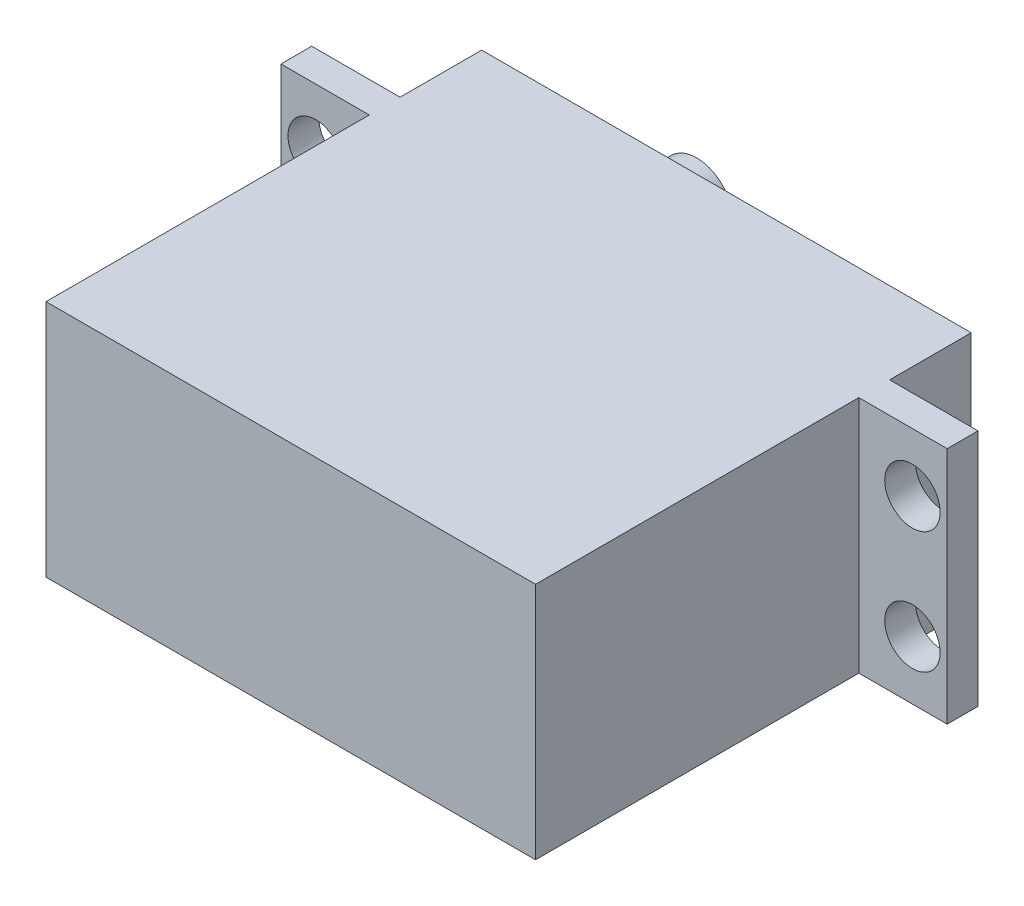
ISO-10303-21;
HEADER;
FILE_DESCRIPTION(('STEP AP214'),'2;1');
FILE_NAME('part.step','',(''),(''),'','','');
FILE_SCHEMA(('AUTOMOTIVE_DESIGN { 1 0 10303 214 1 1 1 1 }'));
ENDSEC;
DATA;
#1=APPLICATION_CONTEXT('core data for automotive mechanical design processes');
#2=APPLICATION_PROTOCOL_DEFINITION('international standard','automotive_design',2000,#1);
#3=PRODUCT_CONTEXT('',#1,'mechanical');
#4=PRODUCT('Part','Part','',(#3));
#5=PRODUCT_RELATED_PRODUCT_CATEGORY('part','',(#4));
#6=PRODUCT_DEFINITION_FORMATION('','',#4);
#7=PRODUCT_DEFINITION_CONTEXT('part definition',#1,'design');
#8=PRODUCT_DEFINITION('design','',#6,#7);
#9=PRODUCT_DEFINITION_SHAPE('','',#8);
#10=(LENGTH_UNIT() NAMED_UNIT(*) SI_UNIT(.MILLI.,.METRE.));
#11=(NAMED_UNIT(*) PLANE_ANGLE_UNIT() SI_UNIT($,.RADIAN.));
#12=(NAMED_UNIT(*) SI_UNIT($,.STERADIAN.) SOLID_ANGLE_UNIT());
#13=UNCERTAINTY_MEASURE_WITH_UNIT(LENGTH_MEASURE(1.E-05),#10,'distance_accuracy_value','');
#14=(GEOMETRIC_REPRESENTATION_CONTEXT(3) GLOBAL_UNCERTAINTY_ASSIGNED_CONTEXT((#13)) GLOBAL_UNIT_ASSIGNED_CONTEXT((#10,
#11,#12)) REPRESENTATION_CONTEXT('',''));
#15=CARTESIAN_POINT('',(0.,0.,0.));
#16=DIRECTION('',(0.,0.,1.));
#17=DIRECTION('',(1.,0.,0.));
#18=AXIS2_PLACEMENT_3D('',#15,#16,#17);
#19=CARTESIAN_POINT('',(0.,19.685,-35.941));
#20=DIRECTION('',(0.,0.,1.));
#21=DIRECTION('',(1.,0.,0.));
#22=AXIS2_PLACEMENT_3D('',#19,#20,#21);
#23=PLANE('',#22);
#24=DIRECTION('',(-1.,0.,0.));
#25=VECTOR('',#24,1.);
#26=CARTESIAN_POINT('',(0.,0.,-35.941));
#27=LINE('',#26,#25);
#28=CARTESIAN_POINT('',(40.386,0.,-35.941));
#29=VERTEX_POINT('',#28);
#30=CARTESIAN_POINT('',(0.,0.,-35.941));
#31=VERTEX_POINT('',#30);
#32=EDGE_CURVE('E215',#29,#31,#27,.T.);
#33=ORIENTED_EDGE('',*,*,#32,.T.);
#34=DIRECTION('',(0.,-1.,0.));
#35=VECTOR('',#34,1.);
#36=CARTESIAN_POINT('',(0.,19.685,-35.941));
#37=LINE('',#36,#35);
#38=CARTESIAN_POINT('',(0.,19.685,-35.941));
#39=VERTEX_POINT('',#38);
#40=EDGE_CURVE('E233',#39,#31,#37,.T.);
#41=ORIENTED_EDGE('',*,*,#40,.F.);
#42=DIRECTION('',(-1.,0.,0.));
#43=VECTOR('',#42,1.);
#44=CARTESIAN_POINT('',(0.,19.685,-35.941));
#45=LINE('',#44,#43);
#46=CARTESIAN_POINT('',(40.386,19.685,-35.941));
#47=VERTEX_POINT('',#46);
#48=EDGE_CURVE('E297',#47,#39,#45,.T.);
#49=ORIENTED_EDGE('',*,*,#48,.F.);
#50=DIRECTION('',(0.,-1.,0.));
#51=VECTOR('',#50,1.);
#52=CARTESIAN_POINT('',(40.386,19.685,-35.941));
#53=LINE('',#52,#51);
#54=EDGE_CURVE('E237',#47,#29,#53,.T.);
#55=ORIENTED_EDGE('',*,*,#54,.T.);
#56=EDGE_LOOP('',(#33,#41,#49,#55));
#57=FACE_BOUND('',#56,.T.);
#58=CARTESIAN_POINT('',(9.7155,9.8425,-35.941));
#59=DIRECTION('',(0.,0.,1.));
#60=DIRECTION('',(1.,0.,0.));
#61=AXIS2_PLACEMENT_3D('',#58,#59,#60);
#62=CIRCLE('',#61,2.9845);
#63=CARTESIAN_POINT('',(12.7,9.8425,-35.941));
#64=VERTEX_POINT('',#63);
#65=EDGE_CURVE('E11',#64,#64,#62,.F.);
#66=ORIENTED_EDGE('',*,*,#65,.F.);
#67=EDGE_LOOP('',(#66));
#68=FACE_BOUND('',#67,.T.);
#69=ADVANCED_FACE('F40',(#57,#68),#23,.F.);
#70=CARTESIAN_POINT('',(0.,19.685,0.));
#71=DIRECTION('',(1.,0.,0.));
#72=DIRECTION('',(0.,0.,-1.));
#73=AXIS2_PLACEMENT_3D('',#70,#71,#72);
#74=PLANE('',#73);
#75=DIRECTION('',(0.,0.,1.));
#76=VECTOR('',#75,1.);
#77=CARTESIAN_POINT('',(0.,0.,0.));
#78=LINE('',#77,#76);
#79=CARTESIAN_POINT('',(0.,0.,-26.67));
#80=VERTEX_POINT('',#79);
#81=CARTESIAN_POINT('',(0.,0.,0.));
#82=VERTEX_POINT('',#81);
#83=EDGE_CURVE('E192',#80,#82,#78,.T.);
#84=ORIENTED_EDGE('',*,*,#83,.T.);
#85=DIRECTION('',(0.,-1.,0.));
#86=VECTOR('',#85,1.);
#87=CARTESIAN_POINT('',(0.,19.685,0.));
#88=LINE('',#87,#86);
#89=CARTESIAN_POINT('',(0.,19.685,0.));
#90=VERTEX_POINT('',#89);
#91=EDGE_CURVE('E50',#90,#82,#88,.T.);
#92=ORIENTED_EDGE('',*,*,#91,.F.);
#93=DIRECTION('',(0.,0.,1.));
#94=VECTOR('',#93,1.);
#95=CARTESIAN_POINT('',(0.,19.685,0.));
#96=LINE('',#95,#94);
#97=CARTESIAN_POINT('',(0.,19.685,-26.67));
#98=VERTEX_POINT('',#97);
#99=EDGE_CURVE('E227',#98,#90,#96,.T.);
#100=ORIENTED_EDGE('',*,*,#99,.F.);
#101=DIRECTION('',(0.,-1.,0.));
#102=VECTOR('',#101,1.);
#103=CARTESIAN_POINT('',(0.,19.685,-26.67));
#104=LINE('',#103,#102);
#105=EDGE_CURVE('E188',#98,#80,#104,.T.);
#106=ORIENTED_EDGE('',*,*,#105,.T.);
#107=EDGE_LOOP('',(#84,#92,#100,#106));
#108=FACE_BOUND('',#107,.T.);
#109=ADVANCED_FACE('F42',(#108),#74,.F.);
#110=CARTESIAN_POINT('',(0.,19.685,0.));
#111=DIRECTION('',(0.,0.,-1.));
#112=DIRECTION('',(-1.,0.,0.));
#113=AXIS2_PLACEMENT_3D('',#110,#111,#112);
#114=PLANE('',#113);
#115=DIRECTION('',(1.,0.,0.));
#116=VECTOR('',#115,1.);
#117=CARTESIAN_POINT('',(0.,0.,0.));
#118=LINE('',#117,#116);
#119=CARTESIAN_POINT('',(40.386,0.,0.));
#120=VERTEX_POINT('',#119);
#121=EDGE_CURVE('E196',#82,#120,#118,.T.);
#122=ORIENTED_EDGE('',*,*,#121,.T.);
#123=DIRECTION('',(0.,-1.,0.));
#124=VECTOR('',#123,1.);
#125=CARTESIAN_POINT('',(40.386,19.685,0.));
#126=LINE('',#125,#124);
#127=CARTESIAN_POINT('',(40.386,19.685,0.));
#128=VERTEX_POINT('',#127);
#129=EDGE_CURVE('E257',#128,#120,#126,.T.);
#130=ORIENTED_EDGE('',*,*,#129,.F.);
#131=DIRECTION('',(1.,0.,0.));
#132=VECTOR('',#131,1.);
#133=CARTESIAN_POINT('',(0.,19.685,0.));
#134=LINE('',#133,#132);
#135=EDGE_CURVE('E133',#90,#128,#134,.T.);
#136=ORIENTED_EDGE('',*,*,#135,.F.);
#137=ORIENTED_EDGE('',*,*,#91,.T.);
#138=EDGE_LOOP('',(#122,#130,#136,#137));
#139=FACE_BOUND('',#138,.T.);
#140=ADVANCED_FACE('F262',(#139),#114,.F.);
#141=CARTESIAN_POINT('',(40.386,19.685,0.));
#142=DIRECTION('',(-1.,0.,0.));
#143=DIRECTION('',(0.,0.,1.));
#144=AXIS2_PLACEMENT_3D('',#141,#142,#143);
#145=PLANE('',#144);
#146=DIRECTION('',(0.,0.,-1.));
#147=VECTOR('',#146,1.);
#148=CARTESIAN_POINT('',(40.386,0.,0.));
#149=LINE('',#148,#147);
#150=CARTESIAN_POINT('',(40.386,0.,-26.67));
#151=VERTEX_POINT('',#150);
#152=EDGE_CURVE('E200',#120,#151,#149,.T.);
#153=ORIENTED_EDGE('',*,*,#152,.T.);
#154=DIRECTION('',(0.,-1.,0.));
#155=VECTOR('',#154,1.);
#156=CARTESIAN_POINT('',(40.386,19.685,-26.67));
#157=LINE('',#156,#155);
#158=CARTESIAN_POINT('',(40.386,19.685,-26.67));
#159=VERTEX_POINT('',#158);
#160=EDGE_CURVE('E253',#159,#151,#157,.T.);
#161=ORIENTED_EDGE('',*,*,#160,.F.);
#162=DIRECTION('',(0.,0.,-1.));
#163=VECTOR('',#162,1.);
#164=CARTESIAN_POINT('',(40.386,19.685,0.));
#165=LINE('',#164,#163);
#166=EDGE_CURVE('E283',#128,#159,#165,.T.);
#167=ORIENTED_EDGE('',*,*,#166,.F.);
#168=ORIENTED_EDGE('',*,*,#129,.T.);
#169=EDGE_LOOP('',(#153,#161,#167,#168));
#170=FACE_BOUND('',#169,.T.);
#171=ADVANCED_FACE('F273',(#170),#145,.F.);
#172=CARTESIAN_POINT('',(40.386,19.685,-26.67));
#173=DIRECTION('',(0.,0.,-1.));
#174=DIRECTION('',(-1.,0.,0.));
#175=AXIS2_PLACEMENT_3D('',#172,#173,#174);
#176=PLANE('',#175);
#177=CARTESIAN_POINT('',(44.8056,4.826,-26.67));
#178=DIRECTION('',(0.,0.,-1.));
#179=DIRECTION('',(-1.,0.,0.));
#180=AXIS2_PLACEMENT_3D('',#177,#178,#179);
#181=CIRCLE('',#180,2.28599999999999);
#182=CARTESIAN_POINT('',(42.5196,4.826,-26.67));
#183=VERTEX_POINT('',#182);
#184=EDGE_CURVE('E320',#183,#183,#181,.F.);
#185=ORIENTED_EDGE('',*,*,#184,.F.);
#186=EDGE_LOOP('',(#185));
#187=FACE_BOUND('',#186,.T.);
#188=CARTESIAN_POINT('',(44.8056,14.859,-26.67));
#189=DIRECTION('',(0.,0.,-1.));
#190=DIRECTION('',(-1.,0.,0.));
#191=AXIS2_PLACEMENT_3D('',#188,#189,#190);
#192=CIRCLE('',#191,2.28599999999999);
#193=CARTESIAN_POINT('',(42.5196,14.859,-26.67));
#194=VERTEX_POINT('',#193);
#195=EDGE_CURVE('E305',#194,#194,#192,.F.);
#196=ORIENTED_EDGE('',*,*,#195,.F.);
#197=EDGE_LOOP('',(#196));
#198=FACE_BOUND('',#197,.T.);
#199=DIRECTION('',(1.,0.,0.));
#200=VECTOR('',#199,1.);
#201=CARTESIAN_POINT('',(40.386,0.,-26.67));
#202=LINE('',#201,#200);
#203=CARTESIAN_POINT('',(47.6758,0.,-26.67));
#204=VERTEX_POINT('',#203);
#205=EDGE_CURVE('E203',#151,#204,#202,.T.);
#206=ORIENTED_EDGE('',*,*,#205,.T.);
#207=DIRECTION('',(0.,-1.,0.));
#208=VECTOR('',#207,1.);
#209=CARTESIAN_POINT('',(47.6758,19.685,-26.67));
#210=LINE('',#209,#208);
#211=CARTESIAN_POINT('',(47.6758,19.685,-26.67));
#212=VERTEX_POINT('',#211);
#213=EDGE_CURVE('E249',#212,#204,#210,.T.);
#214=ORIENTED_EDGE('',*,*,#213,.F.);
#215=DIRECTION('',(1.,0.,0.));
#216=VECTOR('',#215,1.);
#217=CARTESIAN_POINT('',(40.386,19.685,-26.67));
#218=LINE('',#217,#216);
#219=EDGE_CURVE('E279',#159,#212,#218,.T.);
#220=ORIENTED_EDGE('',*,*,#219,.F.);
#221=ORIENTED_EDGE('',*,*,#160,.T.);
#222=EDGE_LOOP('',(#206,#214,#220,#221));
#223=FACE_BOUND('',#222,.T.);
#224=ADVANCED_FACE('F277',(#187,#198,#223),#176,.F.);
#225=CARTESIAN_POINT('',(47.6758,19.685,-26.67));
#226=DIRECTION('',(-1.,0.,0.));
#227=DIRECTION('',(0.,0.,1.));
#228=AXIS2_PLACEMENT_3D('',#225,#226,#227);
#229=PLANE('',#228);
#230=DIRECTION('',(0.,0.,-1.));
#231=VECTOR('',#230,1.);
#232=CARTESIAN_POINT('',(47.6758,0.,-26.67));
#233=LINE('',#232,#231);
#234=CARTESIAN_POINT('',(47.6758,0.,-29.21));
#235=VERTEX_POINT('',#234);
#236=EDGE_CURVE('E206',#204,#235,#233,.T.);
#237=ORIENTED_EDGE('',*,*,#236,.T.);
#238=DIRECTION('',(0.,-1.,0.));
#239=VECTOR('',#238,1.);
#240=CARTESIAN_POINT('',(47.6758,19.685,-29.21));
#241=LINE('',#240,#239);
#242=CARTESIAN_POINT('',(47.6758,19.685,-29.21));
#243=VERTEX_POINT('',#242);
#244=EDGE_CURVE('E245',#243,#235,#241,.T.);
#245=ORIENTED_EDGE('',*,*,#244,.F.);
#246=DIRECTION('',(0.,0.,-1.));
#247=VECTOR('',#246,1.);
#248=CARTESIAN_POINT('',(47.6758,19.685,-26.67));
#249=LINE('',#248,#247);
#250=EDGE_CURVE('E282',#212,#243,#249,.T.);
#251=ORIENTED_EDGE('',*,*,#250,.F.);
#252=ORIENTED_EDGE('',*,*,#213,.T.);
#253=EDGE_LOOP('',(#237,#245,#251,#252));
#254=FACE_BOUND('',#253,.T.);
#255=ADVANCED_FACE('F379',(#254),#229,.F.);
#256=CARTESIAN_POINT('',(40.386,19.685,-29.21));
#257=DIRECTION('',(0.,0.,1.));
#258=DIRECTION('',(1.,0.,0.));
#259=AXIS2_PLACEMENT_3D('',#256,#257,#258);
#260=PLANE('',#259);
#261=CARTESIAN_POINT('',(44.8056,4.826,-29.21));
#262=DIRECTION('',(0.,0.,-1.));
#263=DIRECTION('',(-1.,0.,0.));
#264=AXIS2_PLACEMENT_3D('',#261,#262,#263);
#265=CIRCLE('',#264,2.28599999999999);
#266=CARTESIAN_POINT('',(42.5196,4.826,-29.21));
#267=VERTEX_POINT('',#266);
#268=EDGE_CURVE('E314',#267,#267,#265,.T.);
#269=ORIENTED_EDGE('',*,*,#268,.F.);
#270=EDGE_LOOP('',(#269));
#271=FACE_BOUND('',#270,.T.);
#272=CARTESIAN_POINT('',(44.8056,14.859,-29.21));
#273=DIRECTION('',(0.,0.,-1.));
#274=DIRECTION('',(-1.,0.,0.));
#275=AXIS2_PLACEMENT_3D('',#272,#273,#274);
#276=CIRCLE('',#275,2.28599999999999);
#277=CARTESIAN_POINT('',(42.5196,14.859,-29.21));
#278=VERTEX_POINT('',#277);
#279=EDGE_CURVE('E327',#278,#278,#276,.T.);
#280=ORIENTED_EDGE('',*,*,#279,.F.);
#281=EDGE_LOOP('',(#280));
#282=FACE_BOUND('',#281,.T.);
#283=DIRECTION('',(-1.,0.,0.));
#284=VECTOR('',#283,1.);
#285=CARTESIAN_POINT('',(40.386,0.,-29.21));
#286=LINE('',#285,#284);
#287=CARTESIAN_POINT('',(40.386,0.,-29.21));
#288=VERTEX_POINT('',#287);
#289=EDGE_CURVE('E209',#235,#288,#286,.T.);
#290=ORIENTED_EDGE('',*,*,#289,.T.);
#291=DIRECTION('',(0.,-1.,0.));
#292=VECTOR('',#291,1.);
#293=CARTESIAN_POINT('',(40.386,19.685,-29.21));
#294=LINE('',#293,#292);
#295=CARTESIAN_POINT('',(40.386,19.685,-29.21));
#296=VERTEX_POINT('',#295);
#297=EDGE_CURVE('E241',#296,#288,#294,.T.);
#298=ORIENTED_EDGE('',*,*,#297,.F.);
#299=DIRECTION('',(-1.,0.,0.));
#300=VECTOR('',#299,1.);
#301=CARTESIAN_POINT('',(40.386,19.685,-29.21));
#302=LINE('',#301,#300);
#303=EDGE_CURVE('E287',#243,#296,#302,.T.);
#304=ORIENTED_EDGE('',*,*,#303,.F.);
#305=ORIENTED_EDGE('',*,*,#244,.T.);
#306=EDGE_LOOP('',(#290,#298,#304,#305));
#307=FACE_BOUND('',#306,.T.);
#308=ADVANCED_FACE('F375',(#271,#282,#307),#260,.F.);
#309=CARTESIAN_POINT('',(40.386,19.685,-29.21));
#310=DIRECTION('',(-1.,0.,0.));
#311=DIRECTION('',(0.,0.,1.));
#312=AXIS2_PLACEMENT_3D('',#309,#310,#311);
#313=PLANE('',#312);
#314=DIRECTION('',(0.,0.,-1.));
#315=VECTOR('',#314,1.);
#316=CARTESIAN_POINT('',(40.386,0.,-29.21));
#317=LINE('',#316,#315);
#318=EDGE_CURVE('E212',#288,#29,#317,.T.);
#319=ORIENTED_EDGE('',*,*,#318,.T.);
#320=ORIENTED_EDGE('',*,*,#54,.F.);
#321=DIRECTION('',(0.,0.,-1.));
#322=VECTOR('',#321,1.);
#323=CARTESIAN_POINT('',(40.386,19.685,-29.21));
#324=LINE('',#323,#322);
#325=EDGE_CURVE('E294',#296,#47,#324,.T.);
#326=ORIENTED_EDGE('',*,*,#325,.F.);
#327=ORIENTED_EDGE('',*,*,#297,.T.);
#328=EDGE_LOOP('',(#319,#320,#326,#327));
#329=FACE_BOUND('',#328,.T.);
#330=ADVANCED_FACE('F372',(#329),#313,.F.);
#331=CARTESIAN_POINT('',(0.,19.685,-29.21));
#332=DIRECTION('',(1.,0.,0.));
#333=DIRECTION('',(0.,0.,-1.));
#334=AXIS2_PLACEMENT_3D('',#331,#332,#333);
#335=PLANE('',#334);
#336=DIRECTION('',(0.,0.,1.));
#337=VECTOR('',#336,1.);
#338=CARTESIAN_POINT('',(0.,0.,-29.21));
#339=LINE('',#338,#337);
#340=CARTESIAN_POINT('',(0.,0.,-29.21));
#341=VERTEX_POINT('',#340);
#342=EDGE_CURVE('E218',#31,#341,#339,.T.);
#343=ORIENTED_EDGE('',*,*,#342,.T.);
#344=DIRECTION('',(0.,-1.,0.));
#345=VECTOR('',#344,1.);
#346=CARTESIAN_POINT('',(0.,19.685,-29.21));
#347=LINE('',#346,#345);
#348=CARTESIAN_POINT('',(0.,19.685,-29.21));
#349=VERTEX_POINT('',#348);
#350=EDGE_CURVE('E180',#349,#341,#347,.T.);
#351=ORIENTED_EDGE('',*,*,#350,.F.);
#352=DIRECTION('',(0.,0.,1.));
#353=VECTOR('',#352,1.);
#354=CARTESIAN_POINT('',(0.,19.685,-29.21));
#355=LINE('',#354,#353);
#356=EDGE_CURVE('E169',#39,#349,#355,.T.);
#357=ORIENTED_EDGE('',*,*,#356,.F.);
#358=ORIENTED_EDGE('',*,*,#40,.T.);
#359=EDGE_LOOP('',(#343,#351,#357,#358));
#360=FACE_BOUND('',#359,.T.);
#361=ADVANCED_FACE('F347',(#360),#335,.F.);
#362=CARTESIAN_POINT('',(0.,19.685,-29.21));
#363=DIRECTION('',(0.,0.,1.));
#364=DIRECTION('',(1.,0.,0.));
#365=AXIS2_PLACEMENT_3D('',#362,#363,#364);
#366=PLANE('',#365);
#367=CARTESIAN_POINT('',(-4.4196,4.826,-29.21));
#368=DIRECTION('',(0.,0.,-1.));
#369=DIRECTION('',(-1.,0.,0.));
#370=AXIS2_PLACEMENT_3D('',#367,#368,#369);
#371=CIRCLE('',#370,2.286);
#372=CARTESIAN_POINT('',(-6.7056,4.826,-29.21));
#373=VERTEX_POINT('',#372);
#374=EDGE_CURVE('E336',#373,#373,#371,.T.);
#375=ORIENTED_EDGE('',*,*,#374,.F.);
#376=EDGE_LOOP('',(#375));
#377=FACE_BOUND('',#376,.T.);
#378=CARTESIAN_POINT('',(-4.4196,14.859,-29.21));
#379=DIRECTION('',(0.,0.,-1.));
#380=DIRECTION('',(-1.,0.,0.));
#381=AXIS2_PLACEMENT_3D('',#378,#379,#380);
#382=CIRCLE('',#381,2.286);
#383=CARTESIAN_POINT('',(-6.7056,14.859,-29.21));
#384=VERTEX_POINT('',#383);
#385=EDGE_CURVE('E307',#384,#384,#382,.T.);
#386=ORIENTED_EDGE('',*,*,#385,.F.);
#387=EDGE_LOOP('',(#386));
#388=FACE_BOUND('',#387,.T.);
#389=DIRECTION('',(-1.,0.,0.));
#390=VECTOR('',#389,1.);
#391=CARTESIAN_POINT('',(0.,0.,-29.21));
#392=LINE('',#391,#390);
#393=CARTESIAN_POINT('',(-7.2898,0.,-29.21));
#394=VERTEX_POINT('',#393);
#395=EDGE_CURVE('E178',#341,#394,#392,.T.);
#396=ORIENTED_EDGE('',*,*,#395,.T.);
#397=DIRECTION('',(0.,-1.,0.));
#398=VECTOR('',#397,1.);
#399=CARTESIAN_POINT('',(-7.2898,19.685,-29.21));
#400=LINE('',#399,#398);
#401=CARTESIAN_POINT('',(-7.2898,19.685,-29.21));
#402=VERTEX_POINT('',#401);
#403=EDGE_CURVE('E175',#402,#394,#400,.T.);
#404=ORIENTED_EDGE('',*,*,#403,.F.);
#405=DIRECTION('',(-1.,0.,0.));
#406=VECTOR('',#405,1.);
#407=CARTESIAN_POINT('',(0.,19.685,-29.21));
#408=LINE('',#407,#406);
#409=EDGE_CURVE('E163',#349,#402,#408,.T.);
#410=ORIENTED_EDGE('',*,*,#409,.F.);
#411=ORIENTED_EDGE('',*,*,#350,.T.);
#412=EDGE_LOOP('',(#396,#404,#410,#411));
#413=FACE_BOUND('',#412,.T.);
#414=ADVANCED_FACE('F176',(#377,#388,#413),#366,.F.);
#415=CARTESIAN_POINT('',(-7.2898,19.685,-29.21));
#416=DIRECTION('',(1.,0.,0.));
#417=DIRECTION('',(0.,0.,-1.));
#418=AXIS2_PLACEMENT_3D('',#415,#416,#417);
#419=PLANE('',#418);
#420=DIRECTION('',(0.,0.,1.));
#421=VECTOR('',#420,1.);
#422=CARTESIAN_POINT('',(-7.2898,0.,-29.21));
#423=LINE('',#422,#421);
#424=CARTESIAN_POINT('',(-7.2898,0.,-26.67));
#425=VERTEX_POINT('',#424);
#426=EDGE_CURVE('E114',#394,#425,#423,.T.);
#427=ORIENTED_EDGE('',*,*,#426,.T.);
#428=DIRECTION('',(0.,-1.,0.));
#429=VECTOR('',#428,1.);
#430=CARTESIAN_POINT('',(-7.2898,19.685,-26.67));
#431=LINE('',#430,#429);
#432=CARTESIAN_POINT('',(-7.2898,19.685,-26.67));
#433=VERTEX_POINT('',#432);
#434=EDGE_CURVE('E181',#433,#425,#431,.T.);
#435=ORIENTED_EDGE('',*,*,#434,.F.);
#436=DIRECTION('',(0.,0.,1.));
#437=VECTOR('',#436,1.);
#438=CARTESIAN_POINT('',(-7.2898,19.685,-29.21));
#439=LINE('',#438,#437);
#440=EDGE_CURVE('E167',#402,#433,#439,.T.);
#441=ORIENTED_EDGE('',*,*,#440,.F.);
#442=ORIENTED_EDGE('',*,*,#403,.T.);
#443=EDGE_LOOP('',(#427,#435,#441,#442));
#444=FACE_BOUND('',#443,.T.);
#445=ADVANCED_FACE('F183',(#444),#419,.F.);
#446=CARTESIAN_POINT('',(0.,19.685,-26.67));
#447=DIRECTION('',(0.,0.,-1.));
#448=DIRECTION('',(-1.,0.,0.));
#449=AXIS2_PLACEMENT_3D('',#446,#447,#448);
#450=PLANE('',#449);
#451=CARTESIAN_POINT('',(-4.4196,4.826,-26.67));
#452=DIRECTION('',(0.,0.,-1.));
#453=DIRECTION('',(-1.,0.,0.));
#454=AXIS2_PLACEMENT_3D('',#451,#452,#453);
#455=CIRCLE('',#454,2.286);
#456=CARTESIAN_POINT('',(-6.7056,4.826,-26.67));
#457=VERTEX_POINT('',#456);
#458=EDGE_CURVE('E311',#457,#457,#455,.F.);
#459=ORIENTED_EDGE('',*,*,#458,.F.);
#460=EDGE_LOOP('',(#459));
#461=FACE_BOUND('',#460,.T.);
#462=CARTESIAN_POINT('',(-4.4196,14.859,-26.67));
#463=DIRECTION('',(0.,0.,-1.));
#464=DIRECTION('',(-1.,0.,0.));
#465=AXIS2_PLACEMENT_3D('',#462,#463,#464);
#466=CIRCLE('',#465,2.286);
#467=CARTESIAN_POINT('',(-6.7056,14.859,-26.67));
#468=VERTEX_POINT('',#467);
#469=EDGE_CURVE('E310',#468,#468,#466,.F.);
#470=ORIENTED_EDGE('',*,*,#469,.F.);
#471=EDGE_LOOP('',(#470));
#472=FACE_BOUND('',#471,.T.);
#473=DIRECTION('',(1.,0.,0.));
#474=VECTOR('',#473,1.);
#475=CARTESIAN_POINT('',(0.,0.,-26.67));
#476=LINE('',#475,#474);
#477=EDGE_CURVE('E122',#425,#80,#476,.T.);
#478=ORIENTED_EDGE('',*,*,#477,.T.);
#479=ORIENTED_EDGE('',*,*,#105,.F.);
#480=DIRECTION('',(1.,0.,0.));
#481=VECTOR('',#480,1.);
#482=CARTESIAN_POINT('',(0.,19.685,-26.67));
#483=LINE('',#482,#481);
#484=EDGE_CURVE('E61',#433,#98,#483,.T.);
#485=ORIENTED_EDGE('',*,*,#484,.F.);
#486=ORIENTED_EDGE('',*,*,#434,.T.);
#487=EDGE_LOOP('',(#478,#479,#485,#486));
#488=FACE_BOUND('',#487,.T.);
#489=ADVANCED_FACE('F427',(#461,#472,#488),#450,.F.);
#490=CARTESIAN_POINT('',(0.,19.685,-26.67));
#491=DIRECTION('',(0.,1.,0.));
#492=DIRECTION('',(0.,0.,1.));
#493=AXIS2_PLACEMENT_3D('',#490,#491,#492);
#494=PLANE('',#493);
#495=ORIENTED_EDGE('',*,*,#99,.T.);
#496=ORIENTED_EDGE('',*,*,#135,.T.);
#497=ORIENTED_EDGE('',*,*,#166,.T.);
#498=ORIENTED_EDGE('',*,*,#219,.T.);
#499=ORIENTED_EDGE('',*,*,#250,.T.);
#500=ORIENTED_EDGE('',*,*,#303,.T.);
#501=ORIENTED_EDGE('',*,*,#325,.T.);
#502=ORIENTED_EDGE('',*,*,#48,.T.);
#503=ORIENTED_EDGE('',*,*,#356,.T.);
#504=ORIENTED_EDGE('',*,*,#409,.T.);
#505=ORIENTED_EDGE('',*,*,#440,.T.);
#506=ORIENTED_EDGE('',*,*,#484,.T.);
#507=EDGE_LOOP('',(#495,#496,#497,#498,#499,#500,#501,#502,#503,#504,#505,#506));
#508=FACE_BOUND('',#507,.T.);
#509=ADVANCED_FACE('F165',(#508),#494,.T.);
#510=CARTESIAN_POINT('',(0.,0.,-26.67));
#511=DIRECTION('',(0.,1.,0.));
#512=DIRECTION('',(0.,0.,1.));
#513=AXIS2_PLACEMENT_3D('',#510,#511,#512);
#514=PLANE('',#513);
#515=ORIENTED_EDGE('',*,*,#83,.F.);
#516=ORIENTED_EDGE('',*,*,#477,.F.);
#517=ORIENTED_EDGE('',*,*,#426,.F.);
#518=ORIENTED_EDGE('',*,*,#395,.F.);
#519=ORIENTED_EDGE('',*,*,#342,.F.);
#520=ORIENTED_EDGE('',*,*,#32,.F.);
#521=ORIENTED_EDGE('',*,*,#318,.F.);
#522=ORIENTED_EDGE('',*,*,#289,.F.);
#523=ORIENTED_EDGE('',*,*,#236,.F.);
#524=ORIENTED_EDGE('',*,*,#205,.F.);
#525=ORIENTED_EDGE('',*,*,#152,.F.);
#526=ORIENTED_EDGE('',*,*,#121,.F.);
#527=EDGE_LOOP('',(#515,#516,#517,#518,#519,#520,#521,#522,#523,#524,#525,#526));
#528=FACE_BOUND('',#527,.T.);
#529=ADVANCED_FACE('F267',(#528),#514,.F.);
#530=CARTESIAN_POINT('',(9.7155,9.8425,-43.9674));
#531=DIRECTION('',(0.,0.,1.));
#532=DIRECTION('',(1.,0.,0.));
#533=AXIS2_PLACEMENT_3D('',#530,#531,#532);
#534=CYLINDRICAL_SURFACE('',#533,2.9845);
#535=CARTESIAN_POINT('',(9.7155,9.8425,-43.9674));
#536=DIRECTION('',(0.,0.,-1.));
#537=DIRECTION('',(-1.,0.,0.));
#538=AXIS2_PLACEMENT_3D('',#535,#536,#537);
#539=CIRCLE('',#538,2.9845);
#540=CARTESIAN_POINT('',(6.731,9.8425,-43.9674));
#541=VERTEX_POINT('',#540);
#542=EDGE_CURVE('E197',#541,#541,#539,.T.);
#543=ORIENTED_EDGE('',*,*,#542,.F.);
#544=EDGE_LOOP('',(#543));
#545=FACE_BOUND('',#544,.T.);
#546=ORIENTED_EDGE('',*,*,#65,.T.);
#547=EDGE_LOOP('',(#546));
#548=FACE_BOUND('',#547,.T.);
#549=ADVANCED_FACE('F446',(#545,#548),#534,.T.);
#550=CARTESIAN_POINT('',(9.7155,9.8425,-43.9674));
#551=DIRECTION('',(0.,0.,-1.));
#552=DIRECTION('',(-1.,0.,0.));
#553=AXIS2_PLACEMENT_3D('',#550,#551,#552);
#554=PLANE('',#553);
#555=ORIENTED_EDGE('',*,*,#542,.T.);
#556=EDGE_LOOP('',(#555));
#557=FACE_BOUND('',#556,.T.);
#558=ADVANCED_FACE('F452',(#557),#554,.T.);
#559=CARTESIAN_POINT('',(44.8056,14.859,0.001000000000001));
#560=DIRECTION('',(0.,0.,-1.));
#561=DIRECTION('',(-1.,0.,0.));
#562=AXIS2_PLACEMENT_3D('',#559,#560,#561);
#563=CYLINDRICAL_SURFACE('',#562,2.28599999999999);
#564=ORIENTED_EDGE('',*,*,#279,.T.);
#565=EDGE_LOOP('',(#564));
#566=FACE_BOUND('',#565,.T.);
#567=ORIENTED_EDGE('',*,*,#195,.T.);
#568=EDGE_LOOP('',(#567));
#569=FACE_BOUND('',#568,.T.);
#570=ADVANCED_FACE('F360',(#566,#569),#563,.F.);
#571=CARTESIAN_POINT('',(44.8056,4.826,0.001000000000001));
#572=DIRECTION('',(0.,0.,-1.));
#573=DIRECTION('',(-1.,0.,0.));
#574=AXIS2_PLACEMENT_3D('',#571,#572,#573);
#575=CYLINDRICAL_SURFACE('',#574,2.28599999999999);
#576=ORIENTED_EDGE('',*,*,#268,.T.);
#577=EDGE_LOOP('',(#576));
#578=FACE_BOUND('',#577,.T.);
#579=ORIENTED_EDGE('',*,*,#184,.T.);
#580=EDGE_LOOP('',(#579));
#581=FACE_BOUND('',#580,.T.);
#582=ADVANCED_FACE('F353',(#578,#581),#575,.F.);
#583=CARTESIAN_POINT('',(-4.4196,14.859,0.001000000000001));
#584=DIRECTION('',(0.,0.,-1.));
#585=DIRECTION('',(-1.,0.,0.));
#586=AXIS2_PLACEMENT_3D('',#583,#584,#585);
#587=CYLINDRICAL_SURFACE('',#586,2.286);
#588=ORIENTED_EDGE('',*,*,#385,.T.);
#589=EDGE_LOOP('',(#588));
#590=FACE_BOUND('',#589,.T.);
#591=ORIENTED_EDGE('',*,*,#469,.T.);
#592=EDGE_LOOP('',(#591));
#593=FACE_BOUND('',#592,.T.);
#594=ADVANCED_FACE('F351',(#590,#593),#587,.F.);
#595=CARTESIAN_POINT('',(-4.4196,4.826,0.001000000000001));
#596=DIRECTION('',(0.,0.,-1.));
#597=DIRECTION('',(-1.,0.,0.));
#598=AXIS2_PLACEMENT_3D('',#595,#596,#597);
#599=CYLINDRICAL_SURFACE('',#598,2.286);
#600=ORIENTED_EDGE('',*,*,#374,.T.);
#601=EDGE_LOOP('',(#600));
#602=FACE_BOUND('',#601,.T.);
#603=ORIENTED_EDGE('',*,*,#458,.T.);
#604=EDGE_LOOP('',(#603));
#605=FACE_BOUND('',#604,.T.);
#606=ADVANCED_FACE('F342',(#602,#605),#599,.F.);
#607=CLOSED_SHELL('',(#69,#109,#140,#171,#224,#255,#308,#330,#361,#414,#445,#489,#509,#529,#549,
#558,#570,#582,#594,#606));
#608=MANIFOLD_SOLID_BREP('B2',#607);
#609=ADVANCED_BREP_SHAPE_REPRESENTATION('',(#18,#608),#14);
#610=SHAPE_DEFINITION_REPRESENTATION(#9,#609);
ENDSEC;
END-ISO-10303-21;
